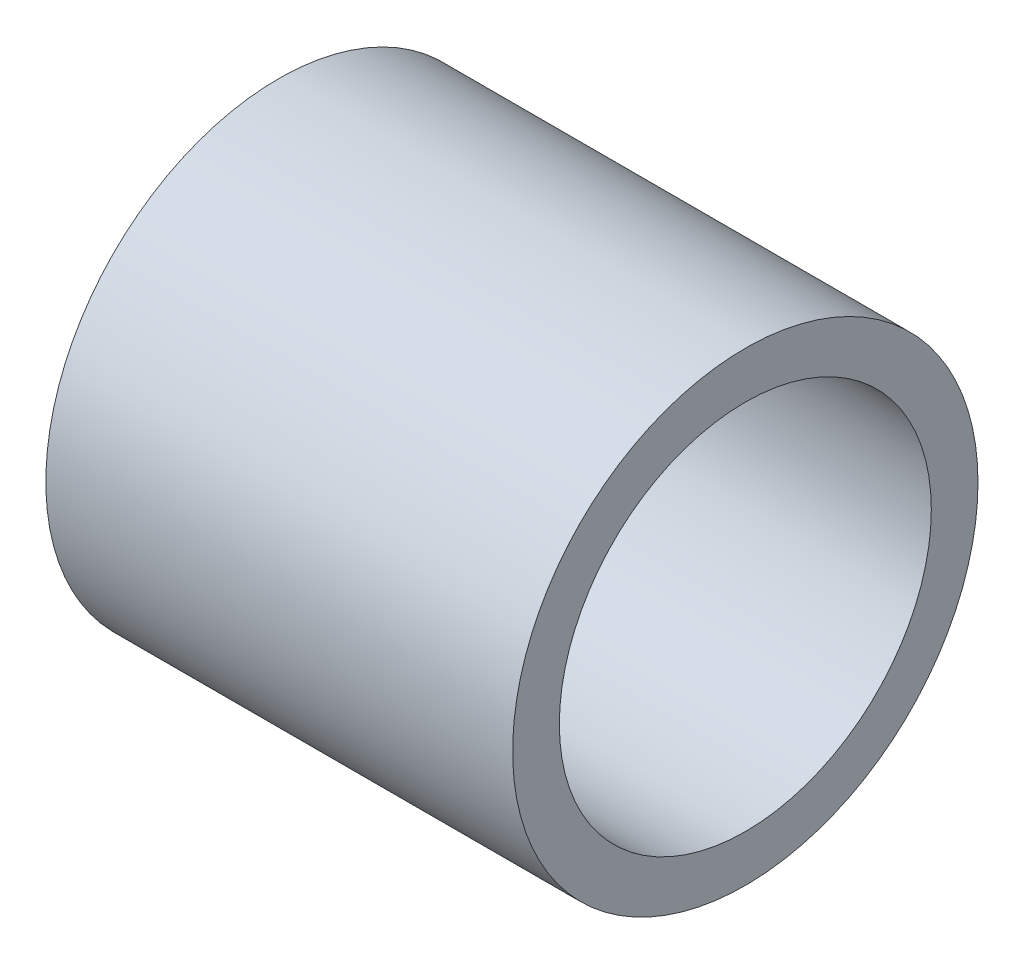
ISO-10303-21;
HEADER;
FILE_DESCRIPTION(('STEP AP214'),'2;1');
FILE_NAME('part.step','',(''),(''),'','','');
FILE_SCHEMA(('AUTOMOTIVE_DESIGN { 1 0 10303 214 1 1 1 1 }'));
ENDSEC;
DATA;
#1=APPLICATION_CONTEXT('core data for automotive mechanical design processes');
#2=APPLICATION_PROTOCOL_DEFINITION('international standard','automotive_design',2000,#1);
#3=PRODUCT_CONTEXT('',#1,'mechanical');
#4=PRODUCT('Part','Part','',(#3));
#5=PRODUCT_RELATED_PRODUCT_CATEGORY('part','',(#4));
#6=PRODUCT_DEFINITION_FORMATION('','',#4);
#7=PRODUCT_DEFINITION_CONTEXT('part definition',#1,'design');
#8=PRODUCT_DEFINITION('design','',#6,#7);
#9=PRODUCT_DEFINITION_SHAPE('','',#8);
#10=(LENGTH_UNIT() NAMED_UNIT(*) SI_UNIT(.MILLI.,.METRE.));
#11=(NAMED_UNIT(*) PLANE_ANGLE_UNIT() SI_UNIT($,.RADIAN.));
#12=(NAMED_UNIT(*) SI_UNIT($,.STERADIAN.) SOLID_ANGLE_UNIT());
#13=UNCERTAINTY_MEASURE_WITH_UNIT(LENGTH_MEASURE(1.E-05),#10,'distance_accuracy_value','');
#14=(GEOMETRIC_REPRESENTATION_CONTEXT(3) GLOBAL_UNCERTAINTY_ASSIGNED_CONTEXT((#13)) GLOBAL_UNIT_ASSIGNED_CONTEXT((#10,
#11,#12)) REPRESENTATION_CONTEXT('',''));
#15=CARTESIAN_POINT('',(0.,0.,0.));
#16=DIRECTION('',(0.,0.,1.));
#17=DIRECTION('',(1.,0.,0.));
#18=AXIS2_PLACEMENT_3D('',#15,#16,#17);
#19=CARTESIAN_POINT('',(31.75,0.,0.));
#20=DIRECTION('',(1.,0.,0.));
#21=DIRECTION('',(0.,0.,-1.));
#22=AXIS2_PLACEMENT_3D('',#19,#20,#21);
#23=PLANE('',#22);
#24=CARTESIAN_POINT('',(31.75,0.,0.));
#25=DIRECTION('',(1.,0.,0.));
#26=DIRECTION('',(0.,0.,-1.));
#27=AXIS2_PLACEMENT_3D('',#24,#25,#26);
#28=CIRCLE('',#27,15.825);
#29=CARTESIAN_POINT('',(31.75,0.,-15.825));
#30=VERTEX_POINT('',#29);
#31=EDGE_CURVE('E10',#30,#30,#28,.T.);
#32=ORIENTED_EDGE('',*,*,#31,.T.);
#33=EDGE_LOOP('',(#32));
#34=FACE_BOUND('',#33,.T.);
#35=CARTESIAN_POINT('',(31.75,0.,0.));
#36=DIRECTION('',(1.,0.,0.));
#37=DIRECTION('',(0.,0.,-1.));
#38=AXIS2_PLACEMENT_3D('',#35,#36,#37);
#39=CIRCLE('',#38,12.65);
#40=CARTESIAN_POINT('',(31.75,0.,-12.65));
#41=VERTEX_POINT('',#40);
#42=EDGE_CURVE('E42',#41,#41,#39,.T.);
#43=ORIENTED_EDGE('',*,*,#42,.F.);
#44=EDGE_LOOP('',(#43));
#45=FACE_BOUND('',#44,.T.);
#46=ADVANCED_FACE('F31',(#34,#45),#23,.T.);
#47=CARTESIAN_POINT('',(0.,0.,0.));
#48=DIRECTION('',(1.,0.,0.));
#49=DIRECTION('',(0.,0.,-1.));
#50=AXIS2_PLACEMENT_3D('',#47,#48,#49);
#51=PLANE('',#50);
#52=CARTESIAN_POINT('',(0.,0.,0.));
#53=DIRECTION('',(1.,0.,0.));
#54=DIRECTION('',(0.,0.,-1.));
#55=AXIS2_PLACEMENT_3D('',#52,#53,#54);
#56=CIRCLE('',#55,15.825);
#57=CARTESIAN_POINT('',(0.,0.,-15.825));
#58=VERTEX_POINT('',#57);
#59=EDGE_CURVE('E35',#58,#58,#56,.T.);
#60=ORIENTED_EDGE('',*,*,#59,.F.);
#61=EDGE_LOOP('',(#60));
#62=FACE_BOUND('',#61,.T.);
#63=CARTESIAN_POINT('',(0.,0.,0.));
#64=DIRECTION('',(1.,0.,0.));
#65=DIRECTION('',(0.,0.,-1.));
#66=AXIS2_PLACEMENT_3D('',#63,#64,#65);
#67=CIRCLE('',#66,12.65);
#68=CARTESIAN_POINT('',(0.,0.,-12.65));
#69=VERTEX_POINT('',#68);
#70=EDGE_CURVE('E44',#69,#69,#67,.T.);
#71=ORIENTED_EDGE('',*,*,#70,.T.);
#72=EDGE_LOOP('',(#71));
#73=FACE_BOUND('',#72,.T.);
#74=ADVANCED_FACE('F54',(#62,#73),#51,.F.);
#75=CARTESIAN_POINT('',(31.75,0.,0.));
#76=DIRECTION('',(-1.,0.,0.));
#77=DIRECTION('',(0.,0.,1.));
#78=AXIS2_PLACEMENT_3D('',#75,#76,#77);
#79=CYLINDRICAL_SURFACE('',#78,15.825);
#80=ORIENTED_EDGE('',*,*,#31,.F.);
#81=EDGE_LOOP('',(#80));
#82=FACE_BOUND('',#81,.T.);
#83=ORIENTED_EDGE('',*,*,#59,.T.);
#84=EDGE_LOOP('',(#83));
#85=FACE_BOUND('',#84,.T.);
#86=ADVANCED_FACE('F33',(#82,#85),#79,.T.);
#87=CARTESIAN_POINT('',(31.75,0.,0.));
#88=DIRECTION('',(-1.,0.,0.));
#89=DIRECTION('',(0.,0.,1.));
#90=AXIS2_PLACEMENT_3D('',#87,#88,#89);
#91=CYLINDRICAL_SURFACE('',#90,12.65);
#92=ORIENTED_EDGE('',*,*,#42,.T.);
#93=EDGE_LOOP('',(#92));
#94=FACE_BOUND('',#93,.T.);
#95=ORIENTED_EDGE('',*,*,#70,.F.);
#96=EDGE_LOOP('',(#95));
#97=FACE_BOUND('',#96,.T.);
#98=ADVANCED_FACE('F50',(#94,#97),#91,.F.);
#99=CLOSED_SHELL('',(#46,#74,#86,#98));
#100=MANIFOLD_SOLID_BREP('B2',#99);
#101=ADVANCED_BREP_SHAPE_REPRESENTATION('',(#18,#100),#14);
#102=SHAPE_DEFINITION_REPRESENTATION(#9,#101);
ENDSEC;
END-ISO-10303-21;
